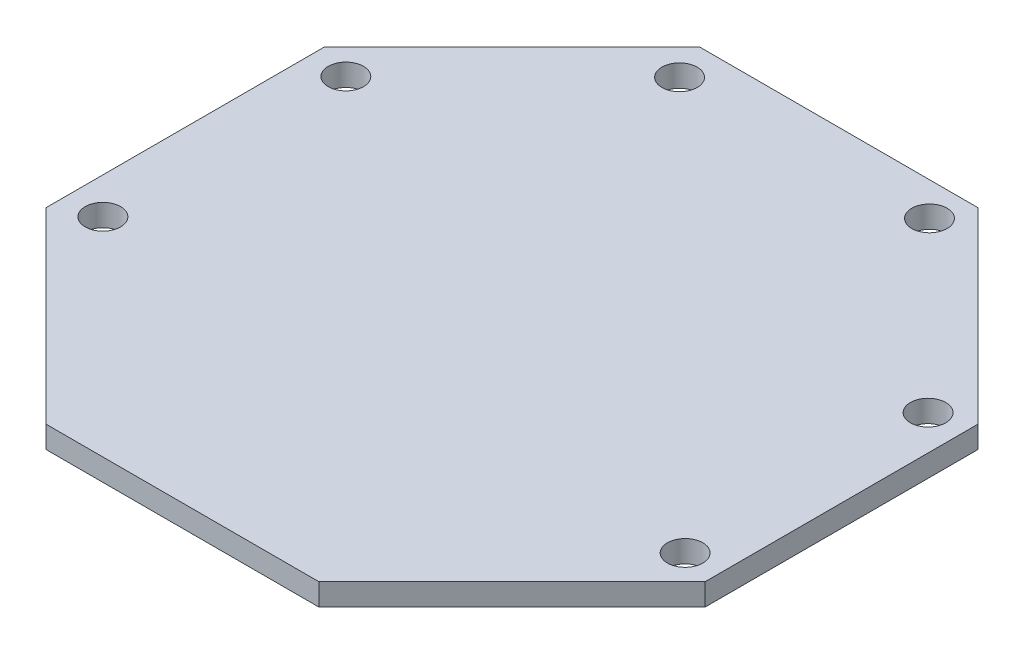
ISO-10303-21;
HEADER;
FILE_DESCRIPTION(('STEP AP214'),'2;1');
FILE_NAME('part.step','',(''),(''),'','','');
FILE_SCHEMA(('AUTOMOTIVE_DESIGN { 1 0 10303 214 1 1 1 1 }'));
ENDSEC;
DATA;
#1=APPLICATION_CONTEXT('core data for automotive mechanical design processes');
#2=APPLICATION_PROTOCOL_DEFINITION('international standard','automotive_design',2000,#1);
#3=PRODUCT_CONTEXT('',#1,'mechanical');
#4=PRODUCT('Part','Part','',(#3));
#5=PRODUCT_RELATED_PRODUCT_CATEGORY('part','',(#4));
#6=PRODUCT_DEFINITION_FORMATION('','',#4);
#7=PRODUCT_DEFINITION_CONTEXT('part definition',#1,'design');
#8=PRODUCT_DEFINITION('design','',#6,#7);
#9=PRODUCT_DEFINITION_SHAPE('','',#8);
#10=(LENGTH_UNIT() NAMED_UNIT(*) SI_UNIT(.MILLI.,.METRE.));
#11=(NAMED_UNIT(*) PLANE_ANGLE_UNIT() SI_UNIT($,.RADIAN.));
#12=(NAMED_UNIT(*) SI_UNIT($,.STERADIAN.) SOLID_ANGLE_UNIT());
#13=UNCERTAINTY_MEASURE_WITH_UNIT(LENGTH_MEASURE(1.E-05),#10,'distance_accuracy_value','');
#14=(GEOMETRIC_REPRESENTATION_CONTEXT(3) GLOBAL_UNCERTAINTY_ASSIGNED_CONTEXT((#13)) GLOBAL_UNIT_ASSIGNED_CONTEXT((#10,
#11,#12)) REPRESENTATION_CONTEXT('',''));
#15=CARTESIAN_POINT('',(0.,0.,0.));
#16=DIRECTION('',(0.,0.,1.));
#17=DIRECTION('',(1.,0.,0.));
#18=AXIS2_PLACEMENT_3D('',#15,#16,#17);
#19=CARTESIAN_POINT('',(0.,2.,0.));
#20=DIRECTION('',(0.,-1.,0.));
#21=DIRECTION('',(0.,0.,-1.));
#22=AXIS2_PLACEMENT_3D('',#19,#20,#21);
#23=PLANE('',#22);
#24=DIRECTION('',(0.707106820155278,0.,-0.707106742217815));
#25=VECTOR('',#24,1.);
#26=CARTESIAN_POINT('',(59.4360246515544,2.,-17.5572080191295));
#27=LINE('',#26,#25);
#28=CARTESIAN_POINT('',(41.8788146972656,2.,0.));
#29=VERTEX_POINT('',#28);
#30=CARTESIAN_POINT('',(59.4360246515544,2.,-17.5572080191295));
#31=VERTEX_POINT('',#30);
#32=EDGE_CURVE('E149',#29,#31,#27,.T.);
#33=ORIENTED_EDGE('',*,*,#32,.T.);
#34=DIRECTION('',(0.,0.,-1.));
#35=VECTOR('',#34,1.);
#36=CARTESIAN_POINT('',(59.4360246515544,2.,-42.3868360098521));
#37=LINE('',#36,#35);
#38=CARTESIAN_POINT('',(59.4360246515544,2.,-42.3868360098521));
#39=VERTEX_POINT('',#38);
#40=EDGE_CURVE('E97',#31,#39,#37,.T.);
#41=ORIENTED_EDGE('',*,*,#40,.T.);
#42=DIRECTION('',(-0.707106742217815,0.,-0.707106820155278));
#43=VECTOR('',#42,1.);
#44=CARTESIAN_POINT('',(42.3868179178518,2.,-59.4360446227221));
#45=LINE('',#44,#43);
#46=CARTESIAN_POINT('',(42.3868179178518,2.,-59.4360446227221));
#47=VERTEX_POINT('',#46);
#48=EDGE_CURVE('E164',#39,#47,#45,.T.);
#49=ORIENTED_EDGE('',*,*,#48,.T.);
#50=DIRECTION('',(-1.,0.,0.));
#51=VECTOR('',#50,1.);
#52=CARTESIAN_POINT('',(17.0491905069632,2.,-59.4360446227221));
#53=LINE('',#52,#51);
#54=CARTESIAN_POINT('',(17.0491905069632,2.,-59.4360446227221));
#55=VERTEX_POINT('',#54);
#56=EDGE_CURVE('E177',#47,#55,#53,.T.);
#57=ORIENTED_EDGE('',*,*,#56,.T.);
#58=DIRECTION('',(-0.707106030253381,0.,0.707107532118917));
#59=VECTOR('',#58,1.);
#60=CARTESIAN_POINT('',(0.,2.,-42.3868179039455));
#61=LINE('',#60,#59);
#62=CARTESIAN_POINT('',(0.,2.,-42.3868179039455));
#63=VERTEX_POINT('',#62);
#64=EDGE_CURVE('E116',#55,#63,#61,.T.);
#65=ORIENTED_EDGE('',*,*,#64,.T.);
#66=DIRECTION('',(0.,0.,1.));
#67=VECTOR('',#66,1.);
#68=CARTESIAN_POINT('',(0.,2.,-17.0491885857082));
#69=LINE('',#68,#67);
#70=CARTESIAN_POINT('',(0.,2.,-17.0491885857082));
#71=VERTEX_POINT('',#70);
#72=EDGE_CURVE('E110',#63,#71,#69,.T.);
#73=ORIENTED_EDGE('',*,*,#72,.T.);
#74=DIRECTION('',(0.707106742217814,0.,0.707106820155279));
#75=VECTOR('',#74,1.);
#76=CARTESIAN_POINT('',(17.049186706543,2.,0.));
#77=LINE('',#76,#75);
#78=CARTESIAN_POINT('',(17.049186706543,2.,0.));
#79=VERTEX_POINT('',#78);
#80=EDGE_CURVE('E114',#71,#79,#77,.T.);
#81=ORIENTED_EDGE('',*,*,#80,.T.);
#82=DIRECTION('',(1.,0.,0.));
#83=VECTOR('',#82,1.);
#84=CARTESIAN_POINT('',(41.8788146972656,2.,0.));
#85=LINE('',#84,#83);
#86=EDGE_CURVE('E54',#79,#29,#85,.T.);
#87=ORIENTED_EDGE('',*,*,#86,.T.);
#88=EDGE_LOOP('',(#33,#41,#49,#57,#65,#73,#81,#87));
#89=FACE_BOUND('',#88,.T.);
#90=CARTESIAN_POINT('',(56.2610007822292,2.,-18.9230258807574));
#91=DIRECTION('',(0.,1.,0.));
#92=DIRECTION('',(0.,0.,1.));
#93=AXIS2_PLACEMENT_3D('',#90,#91,#92);
#94=CIRCLE('',#93,1.6055005788803);
#95=CARTESIAN_POINT('',(56.2610007822292,2.,-17.3175253018771));
#96=VERTEX_POINT('',#95);
#97=EDGE_CURVE('E138',#96,#96,#94,.T.);
#98=ORIENTED_EDGE('',*,*,#97,.F.);
#99=EDGE_LOOP('',(#98));
#100=FACE_BOUND('',#99,.T.);
#101=CARTESIAN_POINT('',(56.2609997275993,2.,-41.0210254535113));
#102=DIRECTION('',(0.,1.,0.));
#103=DIRECTION('',(0.,0.,1.));
#104=AXIS2_PLACEMENT_3D('',#101,#102,#103);
#105=CIRCLE('',#104,1.6055005788803);
#106=CARTESIAN_POINT('',(56.2609997275993,2.,-39.415524874631));
#107=VERTEX_POINT('',#106);
#108=EDGE_CURVE('E186',#107,#107,#105,.T.);
#109=ORIENTED_EDGE('',*,*,#108,.F.);
#110=EDGE_LOOP('',(#109));
#111=FACE_BOUND('',#110,.T.);
#112=CARTESIAN_POINT('',(41.0209980309961,2.,-56.3880253060141));
#113=DIRECTION('',(0.,1.,0.));
#114=DIRECTION('',(0.,0.,1.));
#115=AXIS2_PLACEMENT_3D('',#112,#113,#114);
#116=CIRCLE('',#115,1.60550057888038);
#117=CARTESIAN_POINT('',(41.0209980309961,2.,-54.7825247271338));
#118=VERTEX_POINT('',#117);
#119=EDGE_CURVE('E192',#118,#118,#116,.T.);
#120=ORIENTED_EDGE('',*,*,#119,.F.);
#121=EDGE_LOOP('',(#120));
#122=FACE_BOUND('',#121,.T.);
#123=CARTESIAN_POINT('',(18.5419979515656,2.,-56.1340226157692));
#124=DIRECTION('',(0.,1.,0.));
#125=DIRECTION('',(0.,0.,1.));
#126=AXIS2_PLACEMENT_3D('',#123,#124,#125);
#127=CIRCLE('',#126,1.60550057888027);
#128=CARTESIAN_POINT('',(18.5419979515656,2.,-54.5285220368889));
#129=VERTEX_POINT('',#128);
#130=EDGE_CURVE('E198',#129,#129,#127,.T.);
#131=ORIENTED_EDGE('',*,*,#130,.F.);
#132=EDGE_LOOP('',(#131));
#133=FACE_BOUND('',#132,.T.);
#134=CARTESIAN_POINT('',(3.302000809066,2.,-41.0210229260359));
#135=DIRECTION('',(0.,1.,0.));
#136=DIRECTION('',(0.,0.,1.));
#137=AXIS2_PLACEMENT_3D('',#134,#135,#136);
#138=CIRCLE('',#137,1.60550057888033);
#139=CARTESIAN_POINT('',(3.302000809066,2.,-39.4155223471556));
#140=VERTEX_POINT('',#139);
#141=EDGE_CURVE('E204',#140,#140,#138,.T.);
#142=ORIENTED_EDGE('',*,*,#141,.F.);
#143=EDGE_LOOP('',(#142));
#144=FACE_BOUND('',#143,.T.);
#145=CARTESIAN_POINT('',(3.30200186369599,2.,-18.9230233532821));
#146=DIRECTION('',(0.,1.,0.));
#147=DIRECTION('',(0.,0.,1.));
#148=AXIS2_PLACEMENT_3D('',#145,#146,#147);
#149=CIRCLE('',#148,1.60550057888033);
#150=CARTESIAN_POINT('',(3.30200186369599,2.,-17.3175227744017));
#151=VERTEX_POINT('',#150);
#152=EDGE_CURVE('E210',#151,#151,#149,.T.);
#153=ORIENTED_EDGE('',*,*,#152,.F.);
#154=EDGE_LOOP('',(#153));
#155=FACE_BOUND('',#154,.T.);
#156=ADVANCED_FACE('F37',(#89,#100,#111,#122,#133,#144,#155),#23,.F.);
#157=CARTESIAN_POINT('',(0.,0.,0.));
#158=DIRECTION('',(0.,-1.,0.));
#159=DIRECTION('',(0.,0.,-1.));
#160=AXIS2_PLACEMENT_3D('',#157,#158,#159);
#161=PLANE('',#160);
#162=CARTESIAN_POINT('',(3.302000809066,0.,-41.0210229260359));
#163=DIRECTION('',(0.,1.,0.));
#164=DIRECTION('',(0.,0.,1.));
#165=AXIS2_PLACEMENT_3D('',#162,#163,#164);
#166=CIRCLE('',#165,1.60550057888033);
#167=CARTESIAN_POINT('',(3.302000809066,0.,-39.4155223471556));
#168=VERTEX_POINT('',#167);
#169=EDGE_CURVE('E207',#168,#168,#166,.T.);
#170=ORIENTED_EDGE('',*,*,#169,.T.);
#171=EDGE_LOOP('',(#170));
#172=FACE_BOUND('',#171,.T.);
#173=CARTESIAN_POINT('',(41.0209980309961,0.,-56.3880253060141));
#174=DIRECTION('',(0.,1.,0.));
#175=DIRECTION('',(0.,0.,1.));
#176=AXIS2_PLACEMENT_3D('',#173,#174,#175);
#177=CIRCLE('',#176,1.60550057888038);
#178=CARTESIAN_POINT('',(41.0209980309961,0.,-54.7825247271338));
#179=VERTEX_POINT('',#178);
#180=EDGE_CURVE('E195',#179,#179,#177,.T.);
#181=ORIENTED_EDGE('',*,*,#180,.T.);
#182=EDGE_LOOP('',(#181));
#183=FACE_BOUND('',#182,.T.);
#184=CARTESIAN_POINT('',(56.2610007822292,0.,-18.9230258807574));
#185=DIRECTION('',(0.,1.,0.));
#186=DIRECTION('',(0.,0.,1.));
#187=AXIS2_PLACEMENT_3D('',#184,#185,#186);
#188=CIRCLE('',#187,1.6055005788803);
#189=CARTESIAN_POINT('',(56.2610007822292,0.,-17.3175253018771));
#190=VERTEX_POINT('',#189);
#191=EDGE_CURVE('E183',#190,#190,#188,.T.);
#192=ORIENTED_EDGE('',*,*,#191,.T.);
#193=EDGE_LOOP('',(#192));
#194=FACE_BOUND('',#193,.T.);
#195=DIRECTION('',(0.707106820155278,0.,-0.707106742217815));
#196=VECTOR('',#195,1.);
#197=CARTESIAN_POINT('',(59.4360246515544,0.,-17.5572080191295));
#198=LINE('',#197,#196);
#199=CARTESIAN_POINT('',(41.8788146972656,0.,0.));
#200=VERTEX_POINT('',#199);
#201=CARTESIAN_POINT('',(59.4360246515544,0.,-17.5572080191295));
#202=VERTEX_POINT('',#201);
#203=EDGE_CURVE('E134',#200,#202,#198,.T.);
#204=ORIENTED_EDGE('',*,*,#203,.F.);
#205=DIRECTION('',(1.,0.,0.));
#206=VECTOR('',#205,1.);
#207=CARTESIAN_POINT('',(41.8788146972656,0.,0.));
#208=LINE('',#207,#206);
#209=CARTESIAN_POINT('',(17.049186706543,0.,0.));
#210=VERTEX_POINT('',#209);
#211=EDGE_CURVE('E89',#210,#200,#208,.T.);
#212=ORIENTED_EDGE('',*,*,#211,.F.);
#213=DIRECTION('',(0.707106742217814,0.,0.707106820155279));
#214=VECTOR('',#213,1.);
#215=CARTESIAN_POINT('',(17.049186706543,0.,0.));
#216=LINE('',#215,#214);
#217=CARTESIAN_POINT('',(0.,0.,-17.0491885857082));
#218=VERTEX_POINT('',#217);
#219=EDGE_CURVE('E83',#218,#210,#216,.T.);
#220=ORIENTED_EDGE('',*,*,#219,.F.);
#221=DIRECTION('',(0.,0.,1.));
#222=VECTOR('',#221,1.);
#223=CARTESIAN_POINT('',(0.,0.,-17.0491885857082));
#224=LINE('',#223,#222);
#225=CARTESIAN_POINT('',(0.,0.,-42.3868179039455));
#226=VERTEX_POINT('',#225);
#227=EDGE_CURVE('E124',#226,#218,#224,.T.);
#228=ORIENTED_EDGE('',*,*,#227,.F.);
#229=DIRECTION('',(-0.707106030253381,0.,0.707107532118917));
#230=VECTOR('',#229,1.);
#231=CARTESIAN_POINT('',(0.,0.,-42.3868179039455));
#232=LINE('',#231,#230);
#233=CARTESIAN_POINT('',(17.0491905069632,0.,-59.4360446227221));
#234=VERTEX_POINT('',#233);
#235=EDGE_CURVE('E144',#234,#226,#232,.T.);
#236=ORIENTED_EDGE('',*,*,#235,.F.);
#237=DIRECTION('',(-1.,0.,0.));
#238=VECTOR('',#237,1.);
#239=CARTESIAN_POINT('',(17.0491905069632,0.,-59.4360446227221));
#240=LINE('',#239,#238);
#241=CARTESIAN_POINT('',(42.3868179178518,0.,-59.4360446227221));
#242=VERTEX_POINT('',#241);
#243=EDGE_CURVE('E142',#242,#234,#240,.T.);
#244=ORIENTED_EDGE('',*,*,#243,.F.);
#245=DIRECTION('',(-0.707106742217815,0.,-0.707106820155278));
#246=VECTOR('',#245,1.);
#247=CARTESIAN_POINT('',(42.3868179178518,0.,-59.4360446227221));
#248=LINE('',#247,#246);
#249=CARTESIAN_POINT('',(59.4360246515544,0.,-42.3868360098521));
#250=VERTEX_POINT('',#249);
#251=EDGE_CURVE('E140',#250,#242,#248,.T.);
#252=ORIENTED_EDGE('',*,*,#251,.F.);
#253=DIRECTION('',(0.,0.,-1.));
#254=VECTOR('',#253,1.);
#255=CARTESIAN_POINT('',(59.4360246515544,0.,-42.3868360098521));
#256=LINE('',#255,#254);
#257=EDGE_CURVE('E137',#202,#250,#256,.T.);
#258=ORIENTED_EDGE('',*,*,#257,.F.);
#259=EDGE_LOOP('',(#204,#212,#220,#228,#236,#244,#252,#258));
#260=FACE_BOUND('',#259,.T.);
#261=CARTESIAN_POINT('',(56.2609997275993,0.,-41.0210254535113));
#262=DIRECTION('',(0.,1.,0.));
#263=DIRECTION('',(0.,0.,1.));
#264=AXIS2_PLACEMENT_3D('',#261,#262,#263);
#265=CIRCLE('',#264,1.6055005788803);
#266=CARTESIAN_POINT('',(56.2609997275993,0.,-39.415524874631));
#267=VERTEX_POINT('',#266);
#268=EDGE_CURVE('E189',#267,#267,#265,.T.);
#269=ORIENTED_EDGE('',*,*,#268,.T.);
#270=EDGE_LOOP('',(#269));
#271=FACE_BOUND('',#270,.T.);
#272=CARTESIAN_POINT('',(18.5419979515656,0.,-56.1340226157692));
#273=DIRECTION('',(0.,1.,0.));
#274=DIRECTION('',(0.,0.,1.));
#275=AXIS2_PLACEMENT_3D('',#272,#273,#274);
#276=CIRCLE('',#275,1.60550057888027);
#277=CARTESIAN_POINT('',(18.5419979515656,0.,-54.5285220368889));
#278=VERTEX_POINT('',#277);
#279=EDGE_CURVE('E201',#278,#278,#276,.T.);
#280=ORIENTED_EDGE('',*,*,#279,.T.);
#281=EDGE_LOOP('',(#280));
#282=FACE_BOUND('',#281,.T.);
#283=CARTESIAN_POINT('',(3.30200186369599,0.,-18.9230233532821));
#284=DIRECTION('',(0.,1.,0.));
#285=DIRECTION('',(0.,0.,1.));
#286=AXIS2_PLACEMENT_3D('',#283,#284,#285);
#287=CIRCLE('',#286,1.60550057888033);
#288=CARTESIAN_POINT('',(3.30200186369599,0.,-17.3175227744017));
#289=VERTEX_POINT('',#288);
#290=EDGE_CURVE('E213',#289,#289,#287,.T.);
#291=ORIENTED_EDGE('',*,*,#290,.T.);
#292=EDGE_LOOP('',(#291));
#293=FACE_BOUND('',#292,.T.);
#294=ADVANCED_FACE('F168',(#172,#183,#194,#260,#271,#282,#293),#161,.T.);
#295=CARTESIAN_POINT('',(59.4360246515544,2.,-17.5572080191295));
#296=DIRECTION('',(-0.707106742217815,0.,-0.707106820155278));
#297=DIRECTION('',(-0.707106820155278,0.,0.707106742217815));
#298=AXIS2_PLACEMENT_3D('',#295,#296,#297);
#299=PLANE('',#298);
#300=ORIENTED_EDGE('',*,*,#203,.T.);
#301=DIRECTION('',(0.,-1.,0.));
#302=VECTOR('',#301,1.);
#303=CARTESIAN_POINT('',(59.4360246515544,2.,-17.5572080191295));
#304=LINE('',#303,#302);
#305=EDGE_CURVE('E11',#31,#202,#304,.T.);
#306=ORIENTED_EDGE('',*,*,#305,.F.);
#307=ORIENTED_EDGE('',*,*,#32,.F.);
#308=DIRECTION('',(0.,-1.,0.));
#309=VECTOR('',#308,1.);
#310=CARTESIAN_POINT('',(41.8788146972656,2.,0.));
#311=LINE('',#310,#309);
#312=EDGE_CURVE('E130',#29,#200,#311,.T.);
#313=ORIENTED_EDGE('',*,*,#312,.T.);
#314=EDGE_LOOP('',(#300,#306,#307,#313));
#315=FACE_BOUND('',#314,.T.);
#316=ADVANCED_FACE('F39',(#315),#299,.F.);
#317=CARTESIAN_POINT('',(59.4360246515544,2.,-42.3868360098521));
#318=DIRECTION('',(-1.,0.,0.));
#319=DIRECTION('',(0.,0.,1.));
#320=AXIS2_PLACEMENT_3D('',#317,#318,#319);
#321=PLANE('',#320);
#322=ORIENTED_EDGE('',*,*,#257,.T.);
#323=DIRECTION('',(0.,-1.,0.));
#324=VECTOR('',#323,1.);
#325=CARTESIAN_POINT('',(59.4360246515544,2.,-42.3868360098521));
#326=LINE('',#325,#324);
#327=EDGE_CURVE('E46',#39,#250,#326,.T.);
#328=ORIENTED_EDGE('',*,*,#327,.F.);
#329=ORIENTED_EDGE('',*,*,#40,.F.);
#330=ORIENTED_EDGE('',*,*,#305,.T.);
#331=EDGE_LOOP('',(#322,#328,#329,#330));
#332=FACE_BOUND('',#331,.T.);
#333=ADVANCED_FACE('F245',(#332),#321,.F.);
#334=CARTESIAN_POINT('',(42.3868179178518,2.,-59.4360446227221));
#335=DIRECTION('',(-0.707106820155278,0.,0.707106742217815));
#336=DIRECTION('',(0.707106742217815,0.,0.707106820155278));
#337=AXIS2_PLACEMENT_3D('',#334,#335,#336);
#338=PLANE('',#337);
#339=ORIENTED_EDGE('',*,*,#251,.T.);
#340=DIRECTION('',(0.,-1.,0.));
#341=VECTOR('',#340,1.);
#342=CARTESIAN_POINT('',(42.3868179178518,2.,-59.4360446227221));
#343=LINE('',#342,#341);
#344=EDGE_CURVE('E156',#47,#242,#343,.T.);
#345=ORIENTED_EDGE('',*,*,#344,.F.);
#346=ORIENTED_EDGE('',*,*,#48,.F.);
#347=ORIENTED_EDGE('',*,*,#327,.T.);
#348=EDGE_LOOP('',(#339,#345,#346,#347));
#349=FACE_BOUND('',#348,.T.);
#350=ADVANCED_FACE('F162',(#349),#338,.F.);
#351=CARTESIAN_POINT('',(17.0491905069632,2.,-59.4360446227221));
#352=DIRECTION('',(0.,0.,1.));
#353=DIRECTION('',(1.,0.,0.));
#354=AXIS2_PLACEMENT_3D('',#351,#352,#353);
#355=PLANE('',#354);
#356=ORIENTED_EDGE('',*,*,#243,.T.);
#357=DIRECTION('',(0.,-1.,0.));
#358=VECTOR('',#357,1.);
#359=CARTESIAN_POINT('',(17.0491905069632,2.,-59.4360446227221));
#360=LINE('',#359,#358);
#361=EDGE_CURVE('E153',#55,#234,#360,.T.);
#362=ORIENTED_EDGE('',*,*,#361,.F.);
#363=ORIENTED_EDGE('',*,*,#56,.F.);
#364=ORIENTED_EDGE('',*,*,#344,.T.);
#365=EDGE_LOOP('',(#356,#362,#363,#364));
#366=FACE_BOUND('',#365,.T.);
#367=ADVANCED_FACE('F173',(#366),#355,.F.);
#368=CARTESIAN_POINT('',(0.,2.,-42.3868179039455));
#369=DIRECTION('',(0.707107532118917,0.,0.707106030253381));
#370=DIRECTION('',(0.707106030253381,0.,-0.707107532118917));
#371=AXIS2_PLACEMENT_3D('',#368,#369,#370);
#372=PLANE('',#371);
#373=ORIENTED_EDGE('',*,*,#235,.T.);
#374=DIRECTION('',(0.,-1.,0.));
#375=VECTOR('',#374,1.);
#376=CARTESIAN_POINT('',(0.,2.,-42.3868179039455));
#377=LINE('',#376,#375);
#378=EDGE_CURVE('E125',#63,#226,#377,.T.);
#379=ORIENTED_EDGE('',*,*,#378,.F.);
#380=ORIENTED_EDGE('',*,*,#64,.F.);
#381=ORIENTED_EDGE('',*,*,#361,.T.);
#382=EDGE_LOOP('',(#373,#379,#380,#381));
#383=FACE_BOUND('',#382,.T.);
#384=ADVANCED_FACE('F176',(#383),#372,.F.);
#385=CARTESIAN_POINT('',(0.,2.,-17.0491885857082));
#386=DIRECTION('',(1.,0.,0.));
#387=DIRECTION('',(0.,0.,-1.));
#388=AXIS2_PLACEMENT_3D('',#385,#386,#387);
#389=PLANE('',#388);
#390=ORIENTED_EDGE('',*,*,#227,.T.);
#391=DIRECTION('',(0.,-1.,0.));
#392=VECTOR('',#391,1.);
#393=CARTESIAN_POINT('',(0.,2.,-17.0491885857082));
#394=LINE('',#393,#392);
#395=EDGE_CURVE('E121',#71,#218,#394,.T.);
#396=ORIENTED_EDGE('',*,*,#395,.F.);
#397=ORIENTED_EDGE('',*,*,#72,.F.);
#398=ORIENTED_EDGE('',*,*,#378,.T.);
#399=EDGE_LOOP('',(#390,#396,#397,#398));
#400=FACE_BOUND('',#399,.T.);
#401=ADVANCED_FACE('F122',(#400),#389,.F.);
#402=CARTESIAN_POINT('',(17.049186706543,2.,0.));
#403=DIRECTION('',(0.707106820155279,0.,-0.707106742217814));
#404=DIRECTION('',(-0.707106742217814,0.,-0.707106820155279));
#405=AXIS2_PLACEMENT_3D('',#402,#403,#404);
#406=PLANE('',#405);
#407=ORIENTED_EDGE('',*,*,#219,.T.);
#408=DIRECTION('',(0.,-1.,0.));
#409=VECTOR('',#408,1.);
#410=CARTESIAN_POINT('',(17.049186706543,2.,0.));
#411=LINE('',#410,#409);
#412=EDGE_CURVE('E126',#79,#210,#411,.T.);
#413=ORIENTED_EDGE('',*,*,#412,.F.);
#414=ORIENTED_EDGE('',*,*,#80,.F.);
#415=ORIENTED_EDGE('',*,*,#395,.T.);
#416=EDGE_LOOP('',(#407,#413,#414,#415));
#417=FACE_BOUND('',#416,.T.);
#418=ADVANCED_FACE('F128',(#417),#406,.F.);
#419=CARTESIAN_POINT('',(41.8788146972656,2.,0.));
#420=DIRECTION('',(0.,0.,-1.));
#421=DIRECTION('',(-1.,0.,0.));
#422=AXIS2_PLACEMENT_3D('',#419,#420,#421);
#423=PLANE('',#422);
#424=ORIENTED_EDGE('',*,*,#211,.T.);
#425=ORIENTED_EDGE('',*,*,#312,.F.);
#426=ORIENTED_EDGE('',*,*,#86,.F.);
#427=ORIENTED_EDGE('',*,*,#412,.T.);
#428=EDGE_LOOP('',(#424,#425,#426,#427));
#429=FACE_BOUND('',#428,.T.);
#430=ADVANCED_FACE('F233',(#429),#423,.F.);
#431=CARTESIAN_POINT('',(56.2610007822292,2.,-18.9230258807574));
#432=DIRECTION('',(0.,-1.,0.));
#433=DIRECTION('',(0.,0.,-1.));
#434=AXIS2_PLACEMENT_3D('',#431,#432,#433);
#435=CYLINDRICAL_SURFACE('',#434,1.6055005788803);
#436=ORIENTED_EDGE('',*,*,#97,.T.);
#437=EDGE_LOOP('',(#436));
#438=FACE_BOUND('',#437,.T.);
#439=ORIENTED_EDGE('',*,*,#191,.F.);
#440=EDGE_LOOP('',(#439));
#441=FACE_BOUND('',#440,.T.);
#442=ADVANCED_FACE('F230',(#438,#441),#435,.F.);
#443=CARTESIAN_POINT('',(56.2609997275993,2.,-41.0210254535113));
#444=DIRECTION('',(0.,-1.,0.));
#445=DIRECTION('',(0.,0.,-1.));
#446=AXIS2_PLACEMENT_3D('',#443,#444,#445);
#447=CYLINDRICAL_SURFACE('',#446,1.6055005788803);
#448=ORIENTED_EDGE('',*,*,#108,.T.);
#449=EDGE_LOOP('',(#448));
#450=FACE_BOUND('',#449,.T.);
#451=ORIENTED_EDGE('',*,*,#268,.F.);
#452=EDGE_LOOP('',(#451));
#453=FACE_BOUND('',#452,.T.);
#454=ADVANCED_FACE('F309',(#450,#453),#447,.F.);
#455=CARTESIAN_POINT('',(41.0209980309961,2.,-56.3880253060141));
#456=DIRECTION('',(0.,-1.,0.));
#457=DIRECTION('',(0.,0.,-1.));
#458=AXIS2_PLACEMENT_3D('',#455,#456,#457);
#459=CYLINDRICAL_SURFACE('',#458,1.60550057888038);
#460=ORIENTED_EDGE('',*,*,#119,.T.);
#461=EDGE_LOOP('',(#460));
#462=FACE_BOUND('',#461,.T.);
#463=ORIENTED_EDGE('',*,*,#180,.F.);
#464=EDGE_LOOP('',(#463));
#465=FACE_BOUND('',#464,.T.);
#466=ADVANCED_FACE('F317',(#462,#465),#459,.F.);
#467=CARTESIAN_POINT('',(18.5419979515656,2.,-56.1340226157692));
#468=DIRECTION('',(0.,-1.,0.));
#469=DIRECTION('',(0.,0.,-1.));
#470=AXIS2_PLACEMENT_3D('',#467,#468,#469);
#471=CYLINDRICAL_SURFACE('',#470,1.60550057888027);
#472=ORIENTED_EDGE('',*,*,#130,.T.);
#473=EDGE_LOOP('',(#472));
#474=FACE_BOUND('',#473,.T.);
#475=ORIENTED_EDGE('',*,*,#279,.F.);
#476=EDGE_LOOP('',(#475));
#477=FACE_BOUND('',#476,.T.);
#478=ADVANCED_FACE('F325',(#474,#477),#471,.F.);
#479=CARTESIAN_POINT('',(3.302000809066,2.,-41.0210229260359));
#480=DIRECTION('',(0.,-1.,0.));
#481=DIRECTION('',(0.,0.,-1.));
#482=AXIS2_PLACEMENT_3D('',#479,#480,#481);
#483=CYLINDRICAL_SURFACE('',#482,1.60550057888033);
#484=ORIENTED_EDGE('',*,*,#141,.T.);
#485=EDGE_LOOP('',(#484));
#486=FACE_BOUND('',#485,.T.);
#487=ORIENTED_EDGE('',*,*,#169,.F.);
#488=EDGE_LOOP('',(#487));
#489=FACE_BOUND('',#488,.T.);
#490=ADVANCED_FACE('F334',(#486,#489),#483,.F.);
#491=CARTESIAN_POINT('',(3.30200186369599,2.,-18.9230233532821));
#492=DIRECTION('',(0.,-1.,0.));
#493=DIRECTION('',(0.,0.,-1.));
#494=AXIS2_PLACEMENT_3D('',#491,#492,#493);
#495=CYLINDRICAL_SURFACE('',#494,1.60550057888033);
#496=ORIENTED_EDGE('',*,*,#152,.T.);
#497=EDGE_LOOP('',(#496));
#498=FACE_BOUND('',#497,.T.);
#499=ORIENTED_EDGE('',*,*,#290,.F.);
#500=EDGE_LOOP('',(#499));
#501=FACE_BOUND('',#500,.T.);
#502=ADVANCED_FACE('F219',(#498,#501),#495,.F.);
#503=CLOSED_SHELL('',(#156,#294,#316,#333,#350,#367,#384,#401,#418,#430,#442,#454,#466,#478,
#490,#502));
#504=MANIFOLD_SOLID_BREP('B2',#503);
#505=ADVANCED_BREP_SHAPE_REPRESENTATION('',(#18,#504),#14);
#506=SHAPE_DEFINITION_REPRESENTATION(#9,#505);
ENDSEC;
END-ISO-10303-21;
